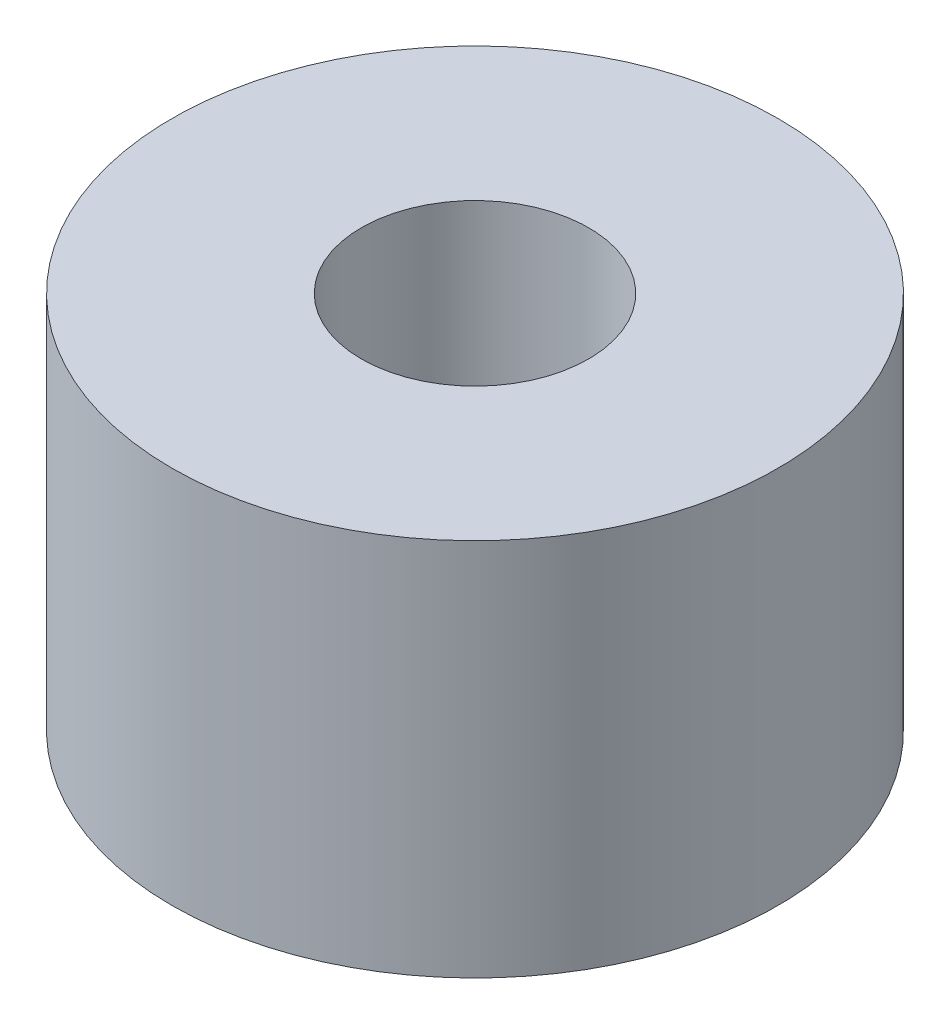
ISO-10303-21;
HEADER;
FILE_DESCRIPTION(('STEP AP214'),'2;1');
FILE_NAME('part.step','',(''),(''),'','','');
FILE_SCHEMA(('AUTOMOTIVE_DESIGN { 1 0 10303 214 1 1 1 1 }'));
ENDSEC;
DATA;
#1=APPLICATION_CONTEXT('core data for automotive mechanical design processes');
#2=APPLICATION_PROTOCOL_DEFINITION('international standard','automotive_design',2000,#1);
#3=PRODUCT_CONTEXT('',#1,'mechanical');
#4=PRODUCT('Part','Part','',(#3));
#5=PRODUCT_RELATED_PRODUCT_CATEGORY('part','',(#4));
#6=PRODUCT_DEFINITION_FORMATION('','',#4);
#7=PRODUCT_DEFINITION_CONTEXT('part definition',#1,'design');
#8=PRODUCT_DEFINITION('design','',#6,#7);
#9=PRODUCT_DEFINITION_SHAPE('','',#8);
#10=(LENGTH_UNIT() NAMED_UNIT(*) SI_UNIT(.MILLI.,.METRE.));
#11=(NAMED_UNIT(*) PLANE_ANGLE_UNIT() SI_UNIT($,.RADIAN.));
#12=(NAMED_UNIT(*) SI_UNIT($,.STERADIAN.) SOLID_ANGLE_UNIT());
#13=UNCERTAINTY_MEASURE_WITH_UNIT(LENGTH_MEASURE(1.E-05),#10,'distance_accuracy_value','');
#14=(GEOMETRIC_REPRESENTATION_CONTEXT(3) GLOBAL_UNCERTAINTY_ASSIGNED_CONTEXT((#13)) GLOBAL_UNIT_ASSIGNED_CONTEXT((#10,
#11,#12)) REPRESENTATION_CONTEXT('',''));
#15=CARTESIAN_POINT('',(0.,0.,0.));
#16=DIRECTION('',(0.,0.,1.));
#17=DIRECTION('',(1.,0.,0.));
#18=AXIS2_PLACEMENT_3D('',#15,#16,#17);
#19=CARTESIAN_POINT('',(0.,10.,0.));
#20=DIRECTION('',(0.,1.,0.));
#21=DIRECTION('',(0.,0.,1.));
#22=AXIS2_PLACEMENT_3D('',#19,#20,#21);
#23=PLANE('',#22);
#24=CARTESIAN_POINT('',(0.,10.,0.));
#25=DIRECTION('',(0.,1.,0.));
#26=DIRECTION('',(0.,0.,1.));
#27=AXIS2_PLACEMENT_3D('',#24,#25,#26);
#28=CIRCLE('',#27,8.);
#29=CARTESIAN_POINT('',(0.,10.,8.));
#30=VERTEX_POINT('',#29);
#31=EDGE_CURVE('E10',#30,#30,#28,.T.);
#32=ORIENTED_EDGE('',*,*,#31,.T.);
#33=EDGE_LOOP('',(#32));
#34=FACE_BOUND('',#33,.T.);
#35=CARTESIAN_POINT('',(0.,10.,0.));
#36=DIRECTION('',(0.,1.,0.));
#37=DIRECTION('',(0.,0.,1.));
#38=AXIS2_PLACEMENT_3D('',#35,#36,#37);
#39=CIRCLE('',#38,3.002);
#40=CARTESIAN_POINT('',(0.,10.,3.002));
#41=VERTEX_POINT('',#40);
#42=EDGE_CURVE('E44',#41,#41,#39,.T.);
#43=ORIENTED_EDGE('',*,*,#42,.F.);
#44=EDGE_LOOP('',(#43));
#45=FACE_BOUND('',#44,.T.);
#46=ADVANCED_FACE('F33',(#34,#45),#23,.T.);
#47=CARTESIAN_POINT('',(0.,0.,0.));
#48=DIRECTION('',(0.,1.,0.));
#49=DIRECTION('',(0.,0.,1.));
#50=AXIS2_PLACEMENT_3D('',#47,#48,#49);
#51=PLANE('',#50);
#52=CARTESIAN_POINT('',(0.,0.,0.));
#53=DIRECTION('',(0.,1.,0.));
#54=DIRECTION('',(0.,0.,1.));
#55=AXIS2_PLACEMENT_3D('',#52,#53,#54);
#56=CIRCLE('',#55,8.);
#57=CARTESIAN_POINT('',(0.,0.,8.));
#58=VERTEX_POINT('',#57);
#59=EDGE_CURVE('E37',#58,#58,#56,.T.);
#60=ORIENTED_EDGE('',*,*,#59,.F.);
#61=EDGE_LOOP('',(#60));
#62=FACE_BOUND('',#61,.T.);
#63=CARTESIAN_POINT('',(0.,0.,0.));
#64=DIRECTION('',(0.,1.,0.));
#65=DIRECTION('',(0.,0.,1.));
#66=AXIS2_PLACEMENT_3D('',#63,#64,#65);
#67=CIRCLE('',#66,3.002);
#68=CARTESIAN_POINT('',(0.,0.,3.002));
#69=VERTEX_POINT('',#68);
#70=EDGE_CURVE('E46',#69,#69,#67,.T.);
#71=ORIENTED_EDGE('',*,*,#70,.T.);
#72=EDGE_LOOP('',(#71));
#73=FACE_BOUND('',#72,.T.);
#74=ADVANCED_FACE('F56',(#62,#73),#51,.F.);
#75=CARTESIAN_POINT('',(0.,10.,0.));
#76=DIRECTION('',(0.,-1.,0.));
#77=DIRECTION('',(0.,0.,-1.));
#78=AXIS2_PLACEMENT_3D('',#75,#76,#77);
#79=CYLINDRICAL_SURFACE('',#78,8.);
#80=ORIENTED_EDGE('',*,*,#31,.F.);
#81=EDGE_LOOP('',(#80));
#82=FACE_BOUND('',#81,.T.);
#83=ORIENTED_EDGE('',*,*,#59,.T.);
#84=EDGE_LOOP('',(#83));
#85=FACE_BOUND('',#84,.T.);
#86=ADVANCED_FACE('F35',(#82,#85),#79,.T.);
#87=CARTESIAN_POINT('',(0.,10.,0.));
#88=DIRECTION('',(0.,-1.,0.));
#89=DIRECTION('',(0.,0.,-1.));
#90=AXIS2_PLACEMENT_3D('',#87,#88,#89);
#91=CYLINDRICAL_SURFACE('',#90,3.002);
#92=ORIENTED_EDGE('',*,*,#42,.T.);
#93=EDGE_LOOP('',(#92));
#94=FACE_BOUND('',#93,.T.);
#95=ORIENTED_EDGE('',*,*,#70,.F.);
#96=EDGE_LOOP('',(#95));
#97=FACE_BOUND('',#96,.T.);
#98=ADVANCED_FACE('F52',(#94,#97),#91,.F.);
#99=CLOSED_SHELL('',(#46,#74,#86,#98));
#100=MANIFOLD_SOLID_BREP('B2',#99);
#101=ADVANCED_BREP_SHAPE_REPRESENTATION('',(#18,#100),#14);
#102=SHAPE_DEFINITION_REPRESENTATION(#9,#101);
ENDSEC;
END-ISO-10303-21;
